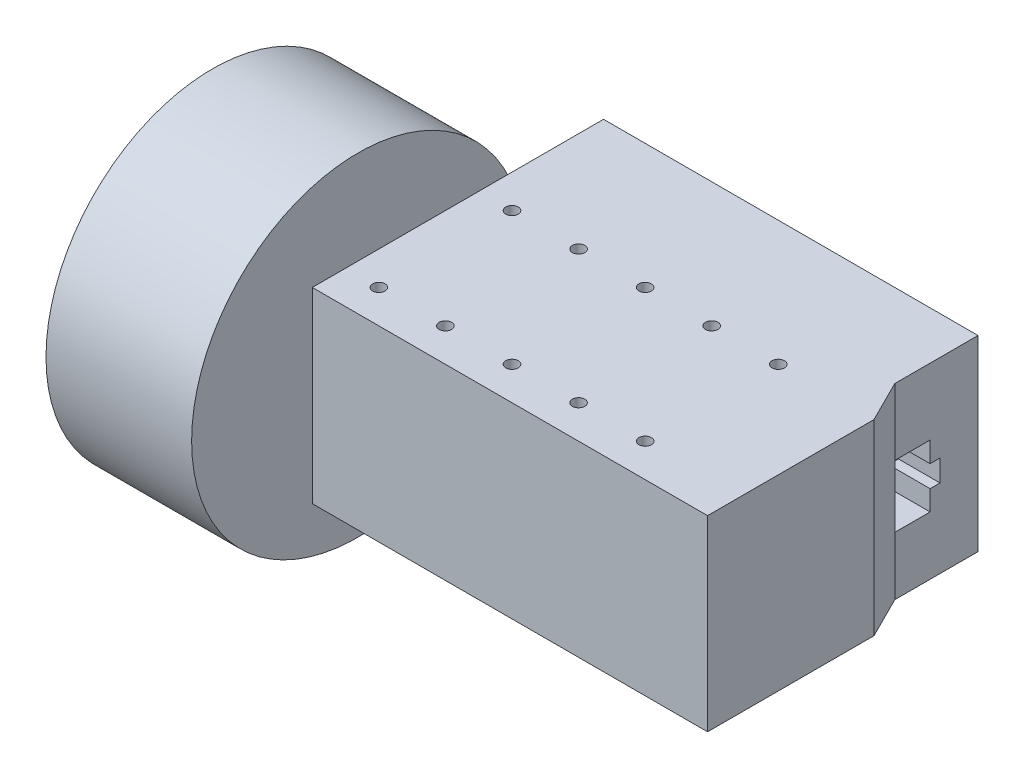
ISO-10303-21;
HEADER;
FILE_DESCRIPTION(('STEP AP214'),'2;1');
FILE_NAME('part.step','',(''),(''),'','','');
FILE_SCHEMA(('AUTOMOTIVE_DESIGN { 1 0 10303 214 1 1 1 1 }'));
ENDSEC;
DATA;
#1=APPLICATION_CONTEXT('core data for automotive mechanical design processes');
#2=APPLICATION_PROTOCOL_DEFINITION('international standard','automotive_design',2000,#1);
#3=PRODUCT_CONTEXT('',#1,'mechanical');
#4=PRODUCT('Part','Part','',(#3));
#5=PRODUCT_RELATED_PRODUCT_CATEGORY('part','',(#4));
#6=PRODUCT_DEFINITION_FORMATION('','',#4);
#7=PRODUCT_DEFINITION_CONTEXT('part definition',#1,'design');
#8=PRODUCT_DEFINITION('design','',#6,#7);
#9=PRODUCT_DEFINITION_SHAPE('','',#8);
#10=(LENGTH_UNIT() NAMED_UNIT(*) SI_UNIT(.MILLI.,.METRE.));
#11=(NAMED_UNIT(*) PLANE_ANGLE_UNIT() SI_UNIT($,.RADIAN.));
#12=(NAMED_UNIT(*) SI_UNIT($,.STERADIAN.) SOLID_ANGLE_UNIT());
#13=UNCERTAINTY_MEASURE_WITH_UNIT(LENGTH_MEASURE(1.E-05),#10,'distance_accuracy_value','');
#14=(GEOMETRIC_REPRESENTATION_CONTEXT(3) GLOBAL_UNCERTAINTY_ASSIGNED_CONTEXT((#13)) GLOBAL_UNIT_ASSIGNED_CONTEXT((#10,
#11,#12)) REPRESENTATION_CONTEXT('',''));
#15=CARTESIAN_POINT('',(0.,0.,0.));
#16=DIRECTION('',(0.,0.,1.));
#17=DIRECTION('',(1.,0.,0.));
#18=AXIS2_PLACEMENT_3D('',#15,#16,#17);
#19=CARTESIAN_POINT('',(0.,45.,0.));
#20=DIRECTION('',(0.,1.,0.));
#21=DIRECTION('',(0.,0.,1.));
#22=AXIS2_PLACEMENT_3D('',#19,#20,#21);
#23=PLANE('',#22);
#24=CARTESIAN_POINT('',(24.4999999999999,45.,-5.));
#25=DIRECTION('',(0.,1.,0.));
#26=DIRECTION('',(0.,0.,1.));
#27=AXIS2_PLACEMENT_3D('',#24,#25,#26);
#28=CIRCLE('',#27,1.5);
#29=CARTESIAN_POINT('',(24.4999999999999,45.,-3.49999999999999));
#30=VERTEX_POINT('',#29);
#31=EDGE_CURVE('E227',#30,#30,#28,.T.);
#32=ORIENTED_EDGE('',*,*,#31,.F.);
#33=EDGE_LOOP('',(#32));
#34=FACE_BOUND('',#33,.T.);
#35=CARTESIAN_POINT('',(-7.50000000000012,45.,-5.));
#36=DIRECTION('',(0.,1.,0.));
#37=DIRECTION('',(0.,0.,1.));
#38=AXIS2_PLACEMENT_3D('',#35,#36,#37);
#39=CIRCLE('',#38,1.5);
#40=CARTESIAN_POINT('',(-7.50000000000012,45.,-3.49999999999999));
#41=VERTEX_POINT('',#40);
#42=EDGE_CURVE('E215',#41,#41,#39,.T.);
#43=ORIENTED_EDGE('',*,*,#42,.F.);
#44=EDGE_LOOP('',(#43));
#45=FACE_BOUND('',#44,.T.);
#46=CARTESIAN_POINT('',(24.5,45.,27.));
#47=DIRECTION('',(0.,1.,0.));
#48=DIRECTION('',(0.,0.,1.));
#49=AXIS2_PLACEMENT_3D('',#46,#47,#48);
#50=CIRCLE('',#49,1.5);
#51=CARTESIAN_POINT('',(24.5,45.,28.5));
#52=VERTEX_POINT('',#51);
#53=EDGE_CURVE('E203',#52,#52,#50,.T.);
#54=ORIENTED_EDGE('',*,*,#53,.F.);
#55=EDGE_LOOP('',(#54));
#56=FACE_BOUND('',#55,.T.);
#57=CARTESIAN_POINT('',(-7.50000000000001,45.,27.));
#58=DIRECTION('',(0.,1.,0.));
#59=DIRECTION('',(0.,0.,1.));
#60=AXIS2_PLACEMENT_3D('',#57,#58,#59);
#61=CIRCLE('',#60,1.5);
#62=CARTESIAN_POINT('',(-7.50000000000001,45.,28.5));
#63=VERTEX_POINT('',#62);
#64=EDGE_CURVE('E191',#63,#63,#61,.T.);
#65=ORIENTED_EDGE('',*,*,#64,.F.);
#66=EDGE_LOOP('',(#65));
#67=FACE_BOUND('',#66,.T.);
#68=CARTESIAN_POINT('',(-39.5,45.,27.));
#69=DIRECTION('',(0.,1.,0.));
#70=DIRECTION('',(0.,0.,1.));
#71=AXIS2_PLACEMENT_3D('',#68,#69,#70);
#72=CIRCLE('',#71,1.5);
#73=CARTESIAN_POINT('',(-39.5,45.,28.5));
#74=VERTEX_POINT('',#73);
#75=EDGE_CURVE('E139',#74,#74,#72,.T.);
#76=ORIENTED_EDGE('',*,*,#75,.F.);
#77=EDGE_LOOP('',(#76));
#78=FACE_BOUND('',#77,.T.);
#79=DIRECTION('',(0.,0.,-1.));
#80=VECTOR('',#79,1.);
#81=CARTESIAN_POINT('',(47.5,45.,-5.));
#82=LINE('',#81,#80);
#83=CARTESIAN_POINT('',(47.5,45.,35.));
#84=VERTEX_POINT('',#83);
#85=CARTESIAN_POINT('',(47.5,45.,-5.));
#86=VERTEX_POINT('',#85);
#87=EDGE_CURVE('E148',#84,#86,#82,.T.);
#88=ORIENTED_EDGE('',*,*,#87,.T.);
#89=DIRECTION('',(-0.44721359549996,0.,-0.894427190999915));
#90=VECTOR('',#89,1.);
#91=CARTESIAN_POINT('',(42.5,45.,-15.));
#92=LINE('',#91,#90);
#93=CARTESIAN_POINT('',(42.5,45.,-15.));
#94=VERTEX_POINT('',#93);
#95=EDGE_CURVE('E97',#86,#94,#92,.T.);
#96=ORIENTED_EDGE('',*,*,#95,.T.);
#97=DIRECTION('',(0.,0.,-1.));
#98=VECTOR('',#97,1.);
#99=CARTESIAN_POINT('',(42.5,45.,-35.));
#100=LINE('',#99,#98);
#101=CARTESIAN_POINT('',(42.5,45.,-35.));
#102=VERTEX_POINT('',#101);
#103=EDGE_CURVE('E114',#94,#102,#100,.T.);
#104=ORIENTED_EDGE('',*,*,#103,.T.);
#105=DIRECTION('',(-1.,0.,0.));
#106=VECTOR('',#105,1.);
#107=CARTESIAN_POINT('',(-47.5,45.,-35.));
#108=LINE('',#107,#106);
#109=CARTESIAN_POINT('',(-47.5,45.,-35.));
#110=VERTEX_POINT('',#109);
#111=EDGE_CURVE('E107',#102,#110,#108,.T.);
#112=ORIENTED_EDGE('',*,*,#111,.T.);
#113=DIRECTION('',(0.,0.,1.));
#114=VECTOR('',#113,1.);
#115=CARTESIAN_POINT('',(-47.5,45.,-35.));
#116=LINE('',#115,#114);
#117=CARTESIAN_POINT('',(-47.5,45.,35.));
#118=VERTEX_POINT('',#117);
#119=EDGE_CURVE('E111',#110,#118,#116,.T.);
#120=ORIENTED_EDGE('',*,*,#119,.T.);
#121=DIRECTION('',(1.,0.,0.));
#122=VECTOR('',#121,1.);
#123=CARTESIAN_POINT('',(-47.5,45.,35.));
#124=LINE('',#123,#122);
#125=EDGE_CURVE('E61',#118,#84,#124,.T.);
#126=ORIENTED_EDGE('',*,*,#125,.T.);
#127=EDGE_LOOP('',(#88,#96,#104,#112,#120,#126));
#128=FACE_BOUND('',#127,.T.);
#129=CARTESIAN_POINT('',(-23.5,45.,27.));
#130=DIRECTION('',(0.,1.,0.));
#131=DIRECTION('',(0.,0.,1.));
#132=AXIS2_PLACEMENT_3D('',#129,#130,#131);
#133=CIRCLE('',#132,1.5);
#134=CARTESIAN_POINT('',(-23.5,45.,28.5));
#135=VERTEX_POINT('',#134);
#136=EDGE_CURVE('E185',#135,#135,#133,.T.);
#137=ORIENTED_EDGE('',*,*,#136,.F.);
#138=EDGE_LOOP('',(#137));
#139=FACE_BOUND('',#138,.T.);
#140=CARTESIAN_POINT('',(8.49999999999999,45.,27.));
#141=DIRECTION('',(0.,1.,0.));
#142=DIRECTION('',(0.,0.,1.));
#143=AXIS2_PLACEMENT_3D('',#140,#141,#142);
#144=CIRCLE('',#143,1.5);
#145=CARTESIAN_POINT('',(8.49999999999999,45.,28.5));
#146=VERTEX_POINT('',#145);
#147=EDGE_CURVE('E197',#146,#146,#144,.T.);
#148=ORIENTED_EDGE('',*,*,#147,.F.);
#149=EDGE_LOOP('',(#148));
#150=FACE_BOUND('',#149,.T.);
#151=CARTESIAN_POINT('',(-23.5000000000001,45.,-5.));
#152=DIRECTION('',(0.,1.,0.));
#153=DIRECTION('',(0.,0.,1.));
#154=AXIS2_PLACEMENT_3D('',#151,#152,#153);
#155=CIRCLE('',#154,1.5);
#156=CARTESIAN_POINT('',(-23.5000000000001,45.,-3.49999999999999));
#157=VERTEX_POINT('',#156);
#158=EDGE_CURVE('E209',#157,#157,#155,.T.);
#159=ORIENTED_EDGE('',*,*,#158,.F.);
#160=EDGE_LOOP('',(#159));
#161=FACE_BOUND('',#160,.T.);
#162=CARTESIAN_POINT('',(8.49999999999988,45.,-5.));
#163=DIRECTION('',(0.,1.,0.));
#164=DIRECTION('',(0.,0.,1.));
#165=AXIS2_PLACEMENT_3D('',#162,#163,#164);
#166=CIRCLE('',#165,1.5);
#167=CARTESIAN_POINT('',(8.49999999999988,45.,-3.49999999999999));
#168=VERTEX_POINT('',#167);
#169=EDGE_CURVE('E221',#168,#168,#166,.T.);
#170=ORIENTED_EDGE('',*,*,#169,.F.);
#171=EDGE_LOOP('',(#170));
#172=FACE_BOUND('',#171,.T.);
#173=CARTESIAN_POINT('',(-39.5000000000001,45.,-5.));
#174=DIRECTION('',(0.,1.,0.));
#175=DIRECTION('',(0.,0.,1.));
#176=AXIS2_PLACEMENT_3D('',#173,#174,#175);
#177=CIRCLE('',#176,1.5);
#178=CARTESIAN_POINT('',(-39.5000000000001,45.,-3.49999999999999));
#179=VERTEX_POINT('',#178);
#180=EDGE_CURVE('E233',#179,#179,#177,.T.);
#181=ORIENTED_EDGE('',*,*,#180,.F.);
#182=EDGE_LOOP('',(#181));
#183=FACE_BOUND('',#182,.T.);
#184=ADVANCED_FACE('F37',(#34,#45,#56,#67,#78,#128,#139,#150,#161,#172,#183),#23,.T.);
#185=CARTESIAN_POINT('',(0.,0.,0.));
#186=DIRECTION('',(0.,1.,0.));
#187=DIRECTION('',(0.,0.,1.));
#188=AXIS2_PLACEMENT_3D('',#185,#186,#187);
#189=PLANE('',#188);
#190=DIRECTION('',(0.,0.,-1.));
#191=VECTOR('',#190,1.);
#192=CARTESIAN_POINT('',(47.5,0.,-5.));
#193=LINE('',#192,#191);
#194=CARTESIAN_POINT('',(47.5,0.,35.));
#195=VERTEX_POINT('',#194);
#196=CARTESIAN_POINT('',(47.5,0.,-5.));
#197=VERTEX_POINT('',#196);
#198=EDGE_CURVE('E135',#195,#197,#193,.T.);
#199=ORIENTED_EDGE('',*,*,#198,.F.);
#200=DIRECTION('',(1.,0.,0.));
#201=VECTOR('',#200,1.);
#202=CARTESIAN_POINT('',(-47.5,0.,35.));
#203=LINE('',#202,#201);
#204=CARTESIAN_POINT('',(-47.5,0.,35.));
#205=VERTEX_POINT('',#204);
#206=EDGE_CURVE('E88',#205,#195,#203,.T.);
#207=ORIENTED_EDGE('',*,*,#206,.F.);
#208=DIRECTION('',(0.,0.,1.));
#209=VECTOR('',#208,1.);
#210=CARTESIAN_POINT('',(-47.5,0.,-35.));
#211=LINE('',#210,#209);
#212=CARTESIAN_POINT('',(-47.5,0.,-35.));
#213=VERTEX_POINT('',#212);
#214=EDGE_CURVE('E145',#213,#205,#211,.T.);
#215=ORIENTED_EDGE('',*,*,#214,.F.);
#216=DIRECTION('',(-1.,0.,0.));
#217=VECTOR('',#216,1.);
#218=CARTESIAN_POINT('',(-47.5,0.,-35.));
#219=LINE('',#218,#217);
#220=CARTESIAN_POINT('',(42.5,0.,-35.));
#221=VERTEX_POINT('',#220);
#222=EDGE_CURVE('E123',#221,#213,#219,.T.);
#223=ORIENTED_EDGE('',*,*,#222,.F.);
#224=DIRECTION('',(0.,0.,-1.));
#225=VECTOR('',#224,1.);
#226=CARTESIAN_POINT('',(42.5,0.,-35.));
#227=LINE('',#226,#225);
#228=CARTESIAN_POINT('',(42.5,0.,-15.));
#229=VERTEX_POINT('',#228);
#230=EDGE_CURVE('E142',#229,#221,#227,.T.);
#231=ORIENTED_EDGE('',*,*,#230,.F.);
#232=DIRECTION('',(-0.44721359549996,0.,-0.894427190999915));
#233=VECTOR('',#232,1.);
#234=CARTESIAN_POINT('',(42.5,0.,-15.));
#235=LINE('',#234,#233);
#236=EDGE_CURVE('E138',#197,#229,#235,.T.);
#237=ORIENTED_EDGE('',*,*,#236,.F.);
#238=EDGE_LOOP('',(#199,#207,#215,#223,#231,#237));
#239=FACE_BOUND('',#238,.T.);
#240=CARTESIAN_POINT('',(-39.5,0.,27.));
#241=DIRECTION('',(0.,1.,0.));
#242=DIRECTION('',(0.,0.,1.));
#243=AXIS2_PLACEMENT_3D('',#240,#241,#242);
#244=CIRCLE('',#243,1.5);
#245=CARTESIAN_POINT('',(-39.5,0.,28.5));
#246=VERTEX_POINT('',#245);
#247=EDGE_CURVE('E182',#246,#246,#244,.T.);
#248=ORIENTED_EDGE('',*,*,#247,.T.);
#249=EDGE_LOOP('',(#248));
#250=FACE_BOUND('',#249,.T.);
#251=CARTESIAN_POINT('',(-23.5,0.,27.));
#252=DIRECTION('',(0.,1.,0.));
#253=DIRECTION('',(0.,0.,1.));
#254=AXIS2_PLACEMENT_3D('',#251,#252,#253);
#255=CIRCLE('',#254,1.5);
#256=CARTESIAN_POINT('',(-23.5,0.,28.5));
#257=VERTEX_POINT('',#256);
#258=EDGE_CURVE('E188',#257,#257,#255,.T.);
#259=ORIENTED_EDGE('',*,*,#258,.T.);
#260=EDGE_LOOP('',(#259));
#261=FACE_BOUND('',#260,.T.);
#262=CARTESIAN_POINT('',(-7.50000000000001,0.,27.));
#263=DIRECTION('',(0.,1.,0.));
#264=DIRECTION('',(0.,0.,1.));
#265=AXIS2_PLACEMENT_3D('',#262,#263,#264);
#266=CIRCLE('',#265,1.5);
#267=CARTESIAN_POINT('',(-7.50000000000001,0.,28.5));
#268=VERTEX_POINT('',#267);
#269=EDGE_CURVE('E194',#268,#268,#266,.T.);
#270=ORIENTED_EDGE('',*,*,#269,.T.);
#271=EDGE_LOOP('',(#270));
#272=FACE_BOUND('',#271,.T.);
#273=CARTESIAN_POINT('',(8.49999999999999,0.,27.));
#274=DIRECTION('',(0.,1.,0.));
#275=DIRECTION('',(0.,0.,1.));
#276=AXIS2_PLACEMENT_3D('',#273,#274,#275);
#277=CIRCLE('',#276,1.5);
#278=CARTESIAN_POINT('',(8.49999999999999,0.,28.5));
#279=VERTEX_POINT('',#278);
#280=EDGE_CURVE('E200',#279,#279,#277,.T.);
#281=ORIENTED_EDGE('',*,*,#280,.T.);
#282=EDGE_LOOP('',(#281));
#283=FACE_BOUND('',#282,.T.);
#284=CARTESIAN_POINT('',(24.5,0.,27.));
#285=DIRECTION('',(0.,1.,0.));
#286=DIRECTION('',(0.,0.,1.));
#287=AXIS2_PLACEMENT_3D('',#284,#285,#286);
#288=CIRCLE('',#287,1.5);
#289=CARTESIAN_POINT('',(24.5,0.,28.5));
#290=VERTEX_POINT('',#289);
#291=EDGE_CURVE('E206',#290,#290,#288,.T.);
#292=ORIENTED_EDGE('',*,*,#291,.T.);
#293=EDGE_LOOP('',(#292));
#294=FACE_BOUND('',#293,.T.);
#295=CARTESIAN_POINT('',(-23.5000000000001,0.,-5.));
#296=DIRECTION('',(0.,1.,0.));
#297=DIRECTION('',(0.,0.,1.));
#298=AXIS2_PLACEMENT_3D('',#295,#296,#297);
#299=CIRCLE('',#298,1.5);
#300=CARTESIAN_POINT('',(-23.5000000000001,0.,-3.49999999999999));
#301=VERTEX_POINT('',#300);
#302=EDGE_CURVE('E212',#301,#301,#299,.T.);
#303=ORIENTED_EDGE('',*,*,#302,.T.);
#304=EDGE_LOOP('',(#303));
#305=FACE_BOUND('',#304,.T.);
#306=CARTESIAN_POINT('',(-7.50000000000012,0.,-5.));
#307=DIRECTION('',(0.,1.,0.));
#308=DIRECTION('',(0.,0.,1.));
#309=AXIS2_PLACEMENT_3D('',#306,#307,#308);
#310=CIRCLE('',#309,1.5);
#311=CARTESIAN_POINT('',(-7.50000000000012,0.,-3.49999999999999));
#312=VERTEX_POINT('',#311);
#313=EDGE_CURVE('E218',#312,#312,#310,.T.);
#314=ORIENTED_EDGE('',*,*,#313,.T.);
#315=EDGE_LOOP('',(#314));
#316=FACE_BOUND('',#315,.T.);
#317=CARTESIAN_POINT('',(8.49999999999988,0.,-5.));
#318=DIRECTION('',(0.,1.,0.));
#319=DIRECTION('',(0.,0.,1.));
#320=AXIS2_PLACEMENT_3D('',#317,#318,#319);
#321=CIRCLE('',#320,1.5);
#322=CARTESIAN_POINT('',(8.49999999999988,0.,-3.49999999999999));
#323=VERTEX_POINT('',#322);
#324=EDGE_CURVE('E224',#323,#323,#321,.T.);
#325=ORIENTED_EDGE('',*,*,#324,.T.);
#326=EDGE_LOOP('',(#325));
#327=FACE_BOUND('',#326,.T.);
#328=CARTESIAN_POINT('',(24.4999999999999,0.,-5.));
#329=DIRECTION('',(0.,1.,0.));
#330=DIRECTION('',(0.,0.,1.));
#331=AXIS2_PLACEMENT_3D('',#328,#329,#330);
#332=CIRCLE('',#331,1.5);
#333=CARTESIAN_POINT('',(24.4999999999999,0.,-3.49999999999999));
#334=VERTEX_POINT('',#333);
#335=EDGE_CURVE('E230',#334,#334,#332,.T.);
#336=ORIENTED_EDGE('',*,*,#335,.T.);
#337=EDGE_LOOP('',(#336));
#338=FACE_BOUND('',#337,.T.);
#339=CARTESIAN_POINT('',(-39.5000000000001,0.,-5.));
#340=DIRECTION('',(0.,1.,0.));
#341=DIRECTION('',(0.,0.,1.));
#342=AXIS2_PLACEMENT_3D('',#339,#340,#341);
#343=CIRCLE('',#342,1.5);
#344=CARTESIAN_POINT('',(-39.5000000000001,0.,-3.49999999999999));
#345=VERTEX_POINT('',#344);
#346=EDGE_CURVE('E236',#345,#345,#343,.T.);
#347=ORIENTED_EDGE('',*,*,#346,.T.);
#348=EDGE_LOOP('',(#347));
#349=FACE_BOUND('',#348,.T.);
#350=ADVANCED_FACE('F163',(#239,#250,#261,#272,#283,#294,#305,#316,#327,#338,#349),#189,.F.);
#351=CARTESIAN_POINT('',(47.5,45.,-5.));
#352=DIRECTION('',(-1.,0.,0.));
#353=DIRECTION('',(0.,0.,1.));
#354=AXIS2_PLACEMENT_3D('',#351,#352,#353);
#355=PLANE('',#354);
#356=ORIENTED_EDGE('',*,*,#198,.T.);
#357=DIRECTION('',(0.,-1.,0.));
#358=VECTOR('',#357,1.);
#359=CARTESIAN_POINT('',(47.5,45.,-5.));
#360=LINE('',#359,#358);
#361=EDGE_CURVE('E45',#86,#197,#360,.T.);
#362=ORIENTED_EDGE('',*,*,#361,.F.);
#363=ORIENTED_EDGE('',*,*,#87,.F.);
#364=DIRECTION('',(0.,-1.,0.));
#365=VECTOR('',#364,1.);
#366=CARTESIAN_POINT('',(47.5,45.,35.));
#367=LINE('',#366,#365);
#368=EDGE_CURVE('E131',#84,#195,#367,.T.);
#369=ORIENTED_EDGE('',*,*,#368,.T.);
#370=EDGE_LOOP('',(#356,#362,#363,#369));
#371=FACE_BOUND('',#370,.T.);
#372=ADVANCED_FACE('F39',(#371),#355,.F.);
#373=CARTESIAN_POINT('',(42.5,45.,-15.));
#374=DIRECTION('',(-0.894427190999915,0.,0.44721359549996));
#375=DIRECTION('',(0.44721359549996,0.,0.894427190999915));
#376=AXIS2_PLACEMENT_3D('',#373,#374,#375);
#377=PLANE('',#376);
#378=ORIENTED_EDGE('',*,*,#236,.T.);
#379=DIRECTION('',(0.,-1.,0.));
#380=VECTOR('',#379,1.);
#381=CARTESIAN_POINT('',(42.5,45.,-15.));
#382=LINE('',#381,#380);
#383=CARTESIAN_POINT('',(42.5,14.0286618360256,-15.));
#384=VERTEX_POINT('',#383);
#385=EDGE_CURVE('E152',#384,#229,#382,.T.);
#386=ORIENTED_EDGE('',*,*,#385,.F.);
#387=DIRECTION('',(0.,-1.,0.));
#388=VECTOR('',#387,1.);
#389=CARTESIAN_POINT('',(42.5,29.0012866665222,-15.));
#390=LINE('',#389,#388);
#391=CARTESIAN_POINT('',(42.5,29.0012866665222,-15.));
#392=VERTEX_POINT('',#391);
#393=EDGE_CURVE('E52',#392,#384,#390,.T.);
#394=ORIENTED_EDGE('',*,*,#393,.F.);
#395=EDGE_CURVE('E153',#94,#392,#382,.T.);
#396=ORIENTED_EDGE('',*,*,#395,.F.);
#397=ORIENTED_EDGE('',*,*,#95,.F.);
#398=ORIENTED_EDGE('',*,*,#361,.T.);
#399=EDGE_LOOP('',(#378,#386,#394,#396,#397,#398));
#400=FACE_BOUND('',#399,.T.);
#401=ADVANCED_FACE('F156',(#400),#377,.F.);
#402=CARTESIAN_POINT('',(42.5,45.,-35.));
#403=DIRECTION('',(-1.,0.,0.));
#404=DIRECTION('',(0.,0.,1.));
#405=AXIS2_PLACEMENT_3D('',#402,#403,#404);
#406=PLANE('',#405);
#407=ORIENTED_EDGE('',*,*,#395,.T.);
#408=DIRECTION('',(0.,0.,1.));
#409=VECTOR('',#408,1.);
#410=CARTESIAN_POINT('',(42.5,29.0012866665222,-15.));
#411=LINE('',#410,#409);
#412=CARTESIAN_POINT('',(42.5,29.0012866665222,-23.4887163929281));
#413=VERTEX_POINT('',#412);
#414=EDGE_CURVE('E178',#413,#392,#411,.T.);
#415=ORIENTED_EDGE('',*,*,#414,.F.);
#416=DIRECTION('',(0.,1.,0.));
#417=VECTOR('',#416,1.);
#418=CARTESIAN_POINT('',(42.5,29.0012866665222,-23.4887163929281));
#419=LINE('',#418,#417);
#420=CARTESIAN_POINT('',(42.5,24.0691278988292,-23.4887163929281));
#421=VERTEX_POINT('',#420);
#422=EDGE_CURVE('E266',#421,#413,#419,.T.);
#423=ORIENTED_EDGE('',*,*,#422,.F.);
#424=DIRECTION('',(0.,0.,1.));
#425=VECTOR('',#424,1.);
#426=CARTESIAN_POINT('',(42.5,24.0691278988292,-25.8667215130658));
#427=LINE('',#426,#425);
#428=CARTESIAN_POINT('',(42.5,24.0691278988292,-25.8667215130658));
#429=VERTEX_POINT('',#428);
#430=EDGE_CURVE('E269',#429,#421,#427,.T.);
#431=ORIENTED_EDGE('',*,*,#430,.F.);
#432=DIRECTION('',(0.,1.,0.));
#433=VECTOR('',#432,1.);
#434=CARTESIAN_POINT('',(42.5,24.0691278988292,-25.8667215130658));
#435=LINE('',#434,#433);
#436=CARTESIAN_POINT('',(42.5,18.8727463400098,-25.8667215130658));
#437=VERTEX_POINT('',#436);
#438=EDGE_CURVE('E272',#437,#429,#435,.T.);
#439=ORIENTED_EDGE('',*,*,#438,.F.);
#440=DIRECTION('',(0.,0.,-1.));
#441=VECTOR('',#440,1.);
#442=CARTESIAN_POINT('',(42.5,18.8727463400098,-25.8667215130658));
#443=LINE('',#442,#441);
#444=CARTESIAN_POINT('',(42.5,18.8727463400098,-23.4887163929281));
#445=VERTEX_POINT('',#444);
#446=EDGE_CURVE('E275',#445,#437,#443,.T.);
#447=ORIENTED_EDGE('',*,*,#446,.F.);
#448=DIRECTION('',(0.,1.,0.));
#449=VECTOR('',#448,1.);
#450=CARTESIAN_POINT('',(42.5,14.0286618360256,-23.4887163929281));
#451=LINE('',#450,#449);
#452=CARTESIAN_POINT('',(42.5,14.0286618360256,-23.4887163929281));
#453=VERTEX_POINT('',#452);
#454=EDGE_CURVE('E278',#453,#445,#451,.T.);
#455=ORIENTED_EDGE('',*,*,#454,.F.);
#456=DIRECTION('',(0.,0.,-1.));
#457=VECTOR('',#456,1.);
#458=CARTESIAN_POINT('',(42.5,14.0286618360256,-15.));
#459=LINE('',#458,#457);
#460=EDGE_CURVE('E170',#384,#453,#459,.T.);
#461=ORIENTED_EDGE('',*,*,#460,.F.);
#462=ORIENTED_EDGE('',*,*,#385,.T.);
#463=ORIENTED_EDGE('',*,*,#230,.T.);
#464=DIRECTION('',(0.,-1.,0.));
#465=VECTOR('',#464,1.);
#466=CARTESIAN_POINT('',(42.5,45.,-35.));
#467=LINE('',#466,#465);
#468=EDGE_CURVE('E126',#102,#221,#467,.T.);
#469=ORIENTED_EDGE('',*,*,#468,.F.);
#470=ORIENTED_EDGE('',*,*,#103,.F.);
#471=EDGE_LOOP('',(#407,#415,#423,#431,#439,#447,#455,#461,#462,#463,#469,#470));
#472=FACE_BOUND('',#471,.T.);
#473=ADVANCED_FACE('F166',(#472),#406,.F.);
#474=CARTESIAN_POINT('',(-47.5,45.,-35.));
#475=DIRECTION('',(0.,0.,1.));
#476=DIRECTION('',(1.,0.,0.));
#477=AXIS2_PLACEMENT_3D('',#474,#475,#476);
#478=PLANE('',#477);
#479=ORIENTED_EDGE('',*,*,#222,.T.);
#480=DIRECTION('',(0.,-1.,0.));
#481=VECTOR('',#480,1.);
#482=CARTESIAN_POINT('',(-47.5,45.,-35.));
#483=LINE('',#482,#481);
#484=EDGE_CURVE('E120',#110,#213,#483,.T.);
#485=ORIENTED_EDGE('',*,*,#484,.F.);
#486=ORIENTED_EDGE('',*,*,#111,.F.);
#487=ORIENTED_EDGE('',*,*,#468,.T.);
#488=EDGE_LOOP('',(#479,#485,#486,#487));
#489=FACE_BOUND('',#488,.T.);
#490=ADVANCED_FACE('F121',(#489),#478,.F.);
#491=CARTESIAN_POINT('',(-47.5,45.,-35.));
#492=DIRECTION('',(1.,0.,0.));
#493=DIRECTION('',(0.,0.,-1.));
#494=AXIS2_PLACEMENT_3D('',#491,#492,#493);
#495=PLANE('',#494);
#496=CARTESIAN_POINT('',(-47.5,22.5,19.));
#497=DIRECTION('',(1.,0.,0.));
#498=DIRECTION('',(0.,0.,-1.));
#499=AXIS2_PLACEMENT_3D('',#496,#497,#498);
#500=CIRCLE('',#499,3.);
#501=CARTESIAN_POINT('',(-47.5,22.5,16.));
#502=VERTEX_POINT('',#501);
#503=EDGE_CURVE('E11',#502,#502,#500,.F.);
#504=ORIENTED_EDGE('',*,*,#503,.F.);
#505=EDGE_LOOP('',(#504));
#506=FACE_BOUND('',#505,.T.);
#507=ORIENTED_EDGE('',*,*,#214,.T.);
#508=DIRECTION('',(0.,-1.,0.));
#509=VECTOR('',#508,1.);
#510=CARTESIAN_POINT('',(-47.5,45.,35.));
#511=LINE('',#510,#509);
#512=EDGE_CURVE('E127',#118,#205,#511,.T.);
#513=ORIENTED_EDGE('',*,*,#512,.F.);
#514=ORIENTED_EDGE('',*,*,#119,.F.);
#515=ORIENTED_EDGE('',*,*,#484,.T.);
#516=EDGE_LOOP('',(#507,#513,#514,#515));
#517=FACE_BOUND('',#516,.T.);
#518=ADVANCED_FACE('F129',(#506,#517),#495,.F.);
#519=CARTESIAN_POINT('',(-47.5,45.,35.));
#520=DIRECTION('',(0.,0.,-1.));
#521=DIRECTION('',(-1.,0.,0.));
#522=AXIS2_PLACEMENT_3D('',#519,#520,#521);
#523=PLANE('',#522);
#524=ORIENTED_EDGE('',*,*,#206,.T.);
#525=ORIENTED_EDGE('',*,*,#368,.F.);
#526=ORIENTED_EDGE('',*,*,#125,.F.);
#527=ORIENTED_EDGE('',*,*,#512,.T.);
#528=EDGE_LOOP('',(#524,#525,#526,#527));
#529=FACE_BOUND('',#528,.T.);
#530=ADVANCED_FACE('F343',(#529),#523,.F.);
#531=CARTESIAN_POINT('',(-39.5,45.,27.));
#532=DIRECTION('',(0.,-1.,0.));
#533=DIRECTION('',(0.,0.,-1.));
#534=AXIS2_PLACEMENT_3D('',#531,#532,#533);
#535=CYLINDRICAL_SURFACE('',#534,1.5);
#536=ORIENTED_EDGE('',*,*,#75,.T.);
#537=EDGE_LOOP('',(#536));
#538=FACE_BOUND('',#537,.T.);
#539=ORIENTED_EDGE('',*,*,#247,.F.);
#540=EDGE_LOOP('',(#539));
#541=FACE_BOUND('',#540,.T.);
#542=ADVANCED_FACE('F340',(#538,#541),#535,.F.);
#543=CARTESIAN_POINT('',(-23.5,45.,27.));
#544=DIRECTION('',(0.,-1.,0.));
#545=DIRECTION('',(0.,0.,-1.));
#546=AXIS2_PLACEMENT_3D('',#543,#544,#545);
#547=CYLINDRICAL_SURFACE('',#546,1.5);
#548=ORIENTED_EDGE('',*,*,#136,.T.);
#549=EDGE_LOOP('',(#548));
#550=FACE_BOUND('',#549,.T.);
#551=ORIENTED_EDGE('',*,*,#258,.F.);
#552=EDGE_LOOP('',(#551));
#553=FACE_BOUND('',#552,.T.);
#554=ADVANCED_FACE('F406',(#550,#553),#547,.F.);
#555=CARTESIAN_POINT('',(-7.50000000000001,45.,27.));
#556=DIRECTION('',(0.,-1.,0.));
#557=DIRECTION('',(0.,0.,-1.));
#558=AXIS2_PLACEMENT_3D('',#555,#556,#557);
#559=CYLINDRICAL_SURFACE('',#558,1.5);
#560=ORIENTED_EDGE('',*,*,#64,.T.);
#561=EDGE_LOOP('',(#560));
#562=FACE_BOUND('',#561,.T.);
#563=ORIENTED_EDGE('',*,*,#269,.F.);
#564=EDGE_LOOP('',(#563));
#565=FACE_BOUND('',#564,.T.);
#566=ADVANCED_FACE('F414',(#562,#565),#559,.F.);
#567=CARTESIAN_POINT('',(8.49999999999999,45.,27.));
#568=DIRECTION('',(0.,-1.,0.));
#569=DIRECTION('',(0.,0.,-1.));
#570=AXIS2_PLACEMENT_3D('',#567,#568,#569);
#571=CYLINDRICAL_SURFACE('',#570,1.5);
#572=ORIENTED_EDGE('',*,*,#147,.T.);
#573=EDGE_LOOP('',(#572));
#574=FACE_BOUND('',#573,.T.);
#575=ORIENTED_EDGE('',*,*,#280,.F.);
#576=EDGE_LOOP('',(#575));
#577=FACE_BOUND('',#576,.T.);
#578=ADVANCED_FACE('F422',(#574,#577),#571,.F.);
#579=CARTESIAN_POINT('',(24.5,45.,27.));
#580=DIRECTION('',(0.,-1.,0.));
#581=DIRECTION('',(0.,0.,-1.));
#582=AXIS2_PLACEMENT_3D('',#579,#580,#581);
#583=CYLINDRICAL_SURFACE('',#582,1.5);
#584=ORIENTED_EDGE('',*,*,#53,.T.);
#585=EDGE_LOOP('',(#584));
#586=FACE_BOUND('',#585,.T.);
#587=ORIENTED_EDGE('',*,*,#291,.F.);
#588=EDGE_LOOP('',(#587));
#589=FACE_BOUND('',#588,.T.);
#590=ADVANCED_FACE('F431',(#586,#589),#583,.F.);
#591=CARTESIAN_POINT('',(-23.5000000000001,45.,-5.));
#592=DIRECTION('',(0.,-1.,0.));
#593=DIRECTION('',(0.,0.,-1.));
#594=AXIS2_PLACEMENT_3D('',#591,#592,#593);
#595=CYLINDRICAL_SURFACE('',#594,1.5);
#596=ORIENTED_EDGE('',*,*,#158,.T.);
#597=EDGE_LOOP('',(#596));
#598=FACE_BOUND('',#597,.T.);
#599=ORIENTED_EDGE('',*,*,#302,.F.);
#600=EDGE_LOOP('',(#599));
#601=FACE_BOUND('',#600,.T.);
#602=ADVANCED_FACE('F440',(#598,#601),#595,.F.);
#603=CARTESIAN_POINT('',(-7.50000000000012,45.,-5.));
#604=DIRECTION('',(0.,-1.,0.));
#605=DIRECTION('',(0.,0.,-1.));
#606=AXIS2_PLACEMENT_3D('',#603,#604,#605);
#607=CYLINDRICAL_SURFACE('',#606,1.5);
#608=ORIENTED_EDGE('',*,*,#42,.T.);
#609=EDGE_LOOP('',(#608));
#610=FACE_BOUND('',#609,.T.);
#611=ORIENTED_EDGE('',*,*,#313,.F.);
#612=EDGE_LOOP('',(#611));
#613=FACE_BOUND('',#612,.T.);
#614=ADVANCED_FACE('F449',(#610,#613),#607,.F.);
#615=CARTESIAN_POINT('',(8.49999999999988,45.,-5.));
#616=DIRECTION('',(0.,-1.,0.));
#617=DIRECTION('',(0.,0.,-1.));
#618=AXIS2_PLACEMENT_3D('',#615,#616,#617);
#619=CYLINDRICAL_SURFACE('',#618,1.5);
#620=ORIENTED_EDGE('',*,*,#169,.T.);
#621=EDGE_LOOP('',(#620));
#622=FACE_BOUND('',#621,.T.);
#623=ORIENTED_EDGE('',*,*,#324,.F.);
#624=EDGE_LOOP('',(#623));
#625=FACE_BOUND('',#624,.T.);
#626=ADVANCED_FACE('F458',(#622,#625),#619,.F.);
#627=CARTESIAN_POINT('',(24.4999999999999,45.,-5.));
#628=DIRECTION('',(0.,-1.,0.));
#629=DIRECTION('',(0.,0.,-1.));
#630=AXIS2_PLACEMENT_3D('',#627,#628,#629);
#631=CYLINDRICAL_SURFACE('',#630,1.5);
#632=ORIENTED_EDGE('',*,*,#31,.T.);
#633=EDGE_LOOP('',(#632));
#634=FACE_BOUND('',#633,.T.);
#635=ORIENTED_EDGE('',*,*,#335,.F.);
#636=EDGE_LOOP('',(#635));
#637=FACE_BOUND('',#636,.T.);
#638=ADVANCED_FACE('F467',(#634,#637),#631,.F.);
#639=CARTESIAN_POINT('',(-39.5000000000001,45.,-5.));
#640=DIRECTION('',(0.,-1.,0.));
#641=DIRECTION('',(0.,0.,-1.));
#642=AXIS2_PLACEMENT_3D('',#639,#640,#641);
#643=CYLINDRICAL_SURFACE('',#642,1.5);
#644=ORIENTED_EDGE('',*,*,#180,.T.);
#645=EDGE_LOOP('',(#644));
#646=FACE_BOUND('',#645,.T.);
#647=ORIENTED_EDGE('',*,*,#346,.F.);
#648=EDGE_LOOP('',(#647));
#649=FACE_BOUND('',#648,.T.);
#650=ADVANCED_FACE('F476',(#646,#649),#643,.F.);
#651=CARTESIAN_POINT('',(32.5,29.0012866665222,-15.));
#652=DIRECTION('',(0.,0.,1.));
#653=DIRECTION('',(1.,0.,0.));
#654=AXIS2_PLACEMENT_3D('',#651,#652,#653);
#655=PLANE('',#654);
#656=ORIENTED_EDGE('',*,*,#393,.T.);
#657=DIRECTION('',(1.,0.,0.));
#658=VECTOR('',#657,1.);
#659=CARTESIAN_POINT('',(32.5,14.0286618360256,-15.));
#660=LINE('',#659,#658);
#661=CARTESIAN_POINT('',(32.5,14.0286618360256,-15.));
#662=VERTEX_POINT('',#661);
#663=EDGE_CURVE('E242',#662,#384,#660,.T.);
#664=ORIENTED_EDGE('',*,*,#663,.F.);
#665=DIRECTION('',(0.,-1.,0.));
#666=VECTOR('',#665,1.);
#667=CARTESIAN_POINT('',(32.5,29.0012866665222,-15.));
#668=LINE('',#667,#666);
#669=CARTESIAN_POINT('',(32.5,29.0012866665222,-15.));
#670=VERTEX_POINT('',#669);
#671=EDGE_CURVE('E265',#670,#662,#668,.T.);
#672=ORIENTED_EDGE('',*,*,#671,.F.);
#673=DIRECTION('',(1.,0.,0.));
#674=VECTOR('',#673,1.);
#675=CARTESIAN_POINT('',(32.5,29.0012866665222,-15.));
#676=LINE('',#675,#674);
#677=EDGE_CURVE('E239',#670,#392,#676,.T.);
#678=ORIENTED_EDGE('',*,*,#677,.T.);
#679=EDGE_LOOP('',(#656,#664,#672,#678));
#680=FACE_BOUND('',#679,.T.);
#681=ADVANCED_FACE('F484',(#680),#655,.F.);
#682=CARTESIAN_POINT('',(32.5,29.0012866665222,-15.));
#683=DIRECTION('',(0.,1.,0.));
#684=DIRECTION('',(0.,0.,1.));
#685=AXIS2_PLACEMENT_3D('',#682,#683,#684);
#686=PLANE('',#685);
#687=ORIENTED_EDGE('',*,*,#414,.T.);
#688=ORIENTED_EDGE('',*,*,#677,.F.);
#689=DIRECTION('',(0.,0.,1.));
#690=VECTOR('',#689,1.);
#691=CARTESIAN_POINT('',(32.5,29.0012866665222,-15.));
#692=LINE('',#691,#690);
#693=CARTESIAN_POINT('',(32.5,29.0012866665222,-23.4887163929281));
#694=VERTEX_POINT('',#693);
#695=EDGE_CURVE('E245',#694,#670,#692,.T.);
#696=ORIENTED_EDGE('',*,*,#695,.F.);
#697=DIRECTION('',(1.,0.,0.));
#698=VECTOR('',#697,1.);
#699=CARTESIAN_POINT('',(32.5,29.0012866665222,-23.4887163929281));
#700=LINE('',#699,#698);
#701=EDGE_CURVE('E260',#694,#413,#700,.T.);
#702=ORIENTED_EDGE('',*,*,#701,.T.);
#703=EDGE_LOOP('',(#687,#688,#696,#702));
#704=FACE_BOUND('',#703,.T.);
#705=ADVANCED_FACE('F492',(#704),#686,.F.);
#706=CARTESIAN_POINT('',(32.5,29.0012866665222,-23.4887163929281));
#707=DIRECTION('',(0.,0.,-1.));
#708=DIRECTION('',(-1.,0.,0.));
#709=AXIS2_PLACEMENT_3D('',#706,#707,#708);
#710=PLANE('',#709);
#711=ORIENTED_EDGE('',*,*,#422,.T.);
#712=ORIENTED_EDGE('',*,*,#701,.F.);
#713=DIRECTION('',(0.,1.,0.));
#714=VECTOR('',#713,1.);
#715=CARTESIAN_POINT('',(32.5,29.0012866665222,-23.4887163929281));
#716=LINE('',#715,#714);
#717=CARTESIAN_POINT('',(32.5,24.0691278988292,-23.4887163929281));
#718=VERTEX_POINT('',#717);
#719=EDGE_CURVE('E284',#718,#694,#716,.T.);
#720=ORIENTED_EDGE('',*,*,#719,.F.);
#721=DIRECTION('',(1.,0.,0.));
#722=VECTOR('',#721,1.);
#723=CARTESIAN_POINT('',(32.5,24.0691278988292,-23.4887163929281));
#724=LINE('',#723,#722);
#725=EDGE_CURVE('E257',#718,#421,#724,.T.);
#726=ORIENTED_EDGE('',*,*,#725,.T.);
#727=EDGE_LOOP('',(#711,#712,#720,#726));
#728=FACE_BOUND('',#727,.T.);
#729=ADVANCED_FACE('F500',(#728),#710,.F.);
#730=CARTESIAN_POINT('',(32.5,24.0691278988292,-25.8667215130658));
#731=DIRECTION('',(0.,1.,0.));
#732=DIRECTION('',(0.,0.,1.));
#733=AXIS2_PLACEMENT_3D('',#730,#731,#732);
#734=PLANE('',#733);
#735=ORIENTED_EDGE('',*,*,#430,.T.);
#736=ORIENTED_EDGE('',*,*,#725,.F.);
#737=DIRECTION('',(0.,0.,1.));
#738=VECTOR('',#737,1.);
#739=CARTESIAN_POINT('',(32.5,24.0691278988292,-25.8667215130658));
#740=LINE('',#739,#738);
#741=CARTESIAN_POINT('',(32.5,24.0691278988292,-25.8667215130658));
#742=VERTEX_POINT('',#741);
#743=EDGE_CURVE('E287',#742,#718,#740,.T.);
#744=ORIENTED_EDGE('',*,*,#743,.F.);
#745=DIRECTION('',(1.,0.,0.));
#746=VECTOR('',#745,1.);
#747=CARTESIAN_POINT('',(32.5,24.0691278988292,-25.8667215130658));
#748=LINE('',#747,#746);
#749=EDGE_CURVE('E254',#742,#429,#748,.T.);
#750=ORIENTED_EDGE('',*,*,#749,.T.);
#751=EDGE_LOOP('',(#735,#736,#744,#750));
#752=FACE_BOUND('',#751,.T.);
#753=ADVANCED_FACE('F509',(#752),#734,.F.);
#754=CARTESIAN_POINT('',(32.5,24.0691278988292,-25.8667215130658));
#755=DIRECTION('',(0.,0.,-1.));
#756=DIRECTION('',(-1.,0.,0.));
#757=AXIS2_PLACEMENT_3D('',#754,#755,#756);
#758=PLANE('',#757);
#759=ORIENTED_EDGE('',*,*,#438,.T.);
#760=ORIENTED_EDGE('',*,*,#749,.F.);
#761=DIRECTION('',(0.,1.,0.));
#762=VECTOR('',#761,1.);
#763=CARTESIAN_POINT('',(32.5,24.0691278988292,-25.8667215130658));
#764=LINE('',#763,#762);
#765=CARTESIAN_POINT('',(32.5,18.8727463400098,-25.8667215130658));
#766=VERTEX_POINT('',#765);
#767=EDGE_CURVE('E290',#766,#742,#764,.T.);
#768=ORIENTED_EDGE('',*,*,#767,.F.);
#769=DIRECTION('',(1.,0.,0.));
#770=VECTOR('',#769,1.);
#771=CARTESIAN_POINT('',(32.5,18.8727463400098,-25.8667215130658));
#772=LINE('',#771,#770);
#773=EDGE_CURVE('E251',#766,#437,#772,.T.);
#774=ORIENTED_EDGE('',*,*,#773,.T.);
#775=EDGE_LOOP('',(#759,#760,#768,#774));
#776=FACE_BOUND('',#775,.T.);
#777=ADVANCED_FACE('F518',(#776),#758,.F.);
#778=CARTESIAN_POINT('',(32.5,18.8727463400098,-25.8667215130658));
#779=DIRECTION('',(0.,-1.,0.));
#780=DIRECTION('',(0.,0.,-1.));
#781=AXIS2_PLACEMENT_3D('',#778,#779,#780);
#782=PLANE('',#781);
#783=ORIENTED_EDGE('',*,*,#446,.T.);
#784=ORIENTED_EDGE('',*,*,#773,.F.);
#785=DIRECTION('',(0.,0.,-1.));
#786=VECTOR('',#785,1.);
#787=CARTESIAN_POINT('',(32.5,18.8727463400098,-25.8667215130658));
#788=LINE('',#787,#786);
#789=CARTESIAN_POINT('',(32.5,18.8727463400098,-23.4887163929281));
#790=VERTEX_POINT('',#789);
#791=EDGE_CURVE('E293',#790,#766,#788,.T.);
#792=ORIENTED_EDGE('',*,*,#791,.F.);
#793=DIRECTION('',(1.,0.,0.));
#794=VECTOR('',#793,1.);
#795=CARTESIAN_POINT('',(32.5,18.8727463400098,-23.4887163929281));
#796=LINE('',#795,#794);
#797=EDGE_CURVE('E248',#790,#445,#796,.T.);
#798=ORIENTED_EDGE('',*,*,#797,.T.);
#799=EDGE_LOOP('',(#783,#784,#792,#798));
#800=FACE_BOUND('',#799,.T.);
#801=ADVANCED_FACE('F527',(#800),#782,.F.);
#802=CARTESIAN_POINT('',(32.5,14.0286618360256,-23.4887163929281));
#803=DIRECTION('',(0.,0.,-1.));
#804=DIRECTION('',(-1.,0.,0.));
#805=AXIS2_PLACEMENT_3D('',#802,#803,#804);
#806=PLANE('',#805);
#807=ORIENTED_EDGE('',*,*,#454,.T.);
#808=ORIENTED_EDGE('',*,*,#797,.F.);
#809=DIRECTION('',(0.,1.,0.));
#810=VECTOR('',#809,1.);
#811=CARTESIAN_POINT('',(32.5,14.0286618360256,-23.4887163929281));
#812=LINE('',#811,#810);
#813=CARTESIAN_POINT('',(32.5,14.0286618360256,-23.4887163929281));
#814=VERTEX_POINT('',#813);
#815=EDGE_CURVE('E296',#814,#790,#812,.T.);
#816=ORIENTED_EDGE('',*,*,#815,.F.);
#817=DIRECTION('',(1.,0.,0.));
#818=VECTOR('',#817,1.);
#819=CARTESIAN_POINT('',(32.5,14.0286618360256,-23.4887163929281));
#820=LINE('',#819,#818);
#821=EDGE_CURVE('E244',#814,#453,#820,.T.);
#822=ORIENTED_EDGE('',*,*,#821,.T.);
#823=EDGE_LOOP('',(#807,#808,#816,#822));
#824=FACE_BOUND('',#823,.T.);
#825=ADVANCED_FACE('F536',(#824),#806,.F.);
#826=CARTESIAN_POINT('',(32.5,14.0286618360256,-15.));
#827=DIRECTION('',(0.,-1.,0.));
#828=DIRECTION('',(0.,0.,-1.));
#829=AXIS2_PLACEMENT_3D('',#826,#827,#828);
#830=PLANE('',#829);
#831=ORIENTED_EDGE('',*,*,#460,.T.);
#832=ORIENTED_EDGE('',*,*,#821,.F.);
#833=DIRECTION('',(0.,0.,-1.));
#834=VECTOR('',#833,1.);
#835=CARTESIAN_POINT('',(32.5,14.0286618360256,-15.));
#836=LINE('',#835,#834);
#837=EDGE_CURVE('E299',#662,#814,#836,.T.);
#838=ORIENTED_EDGE('',*,*,#837,.F.);
#839=ORIENTED_EDGE('',*,*,#663,.T.);
#840=EDGE_LOOP('',(#831,#832,#838,#839));
#841=FACE_BOUND('',#840,.T.);
#842=ADVANCED_FACE('F545',(#841),#830,.F.);
#843=CARTESIAN_POINT('',(32.5,0.,0.));
#844=DIRECTION('',(1.,0.,0.));
#845=DIRECTION('',(0.,0.,-1.));
#846=AXIS2_PLACEMENT_3D('',#843,#844,#845);
#847=PLANE('',#846);
#848=ORIENTED_EDGE('',*,*,#671,.T.);
#849=ORIENTED_EDGE('',*,*,#837,.T.);
#850=ORIENTED_EDGE('',*,*,#815,.T.);
#851=ORIENTED_EDGE('',*,*,#791,.T.);
#852=ORIENTED_EDGE('',*,*,#767,.T.);
#853=ORIENTED_EDGE('',*,*,#743,.T.);
#854=ORIENTED_EDGE('',*,*,#719,.T.);
#855=ORIENTED_EDGE('',*,*,#695,.T.);
#856=EDGE_LOOP('',(#848,#849,#850,#851,#852,#853,#854,#855));
#857=FACE_BOUND('',#856,.T.);
#858=ADVANCED_FACE('F554',(#857),#847,.T.);
#859=CARTESIAN_POINT('',(-52.5,22.5,19.));
#860=DIRECTION('',(1.,0.,0.));
#861=DIRECTION('',(0.,0.,-1.));
#862=AXIS2_PLACEMENT_3D('',#859,#860,#861);
#863=CYLINDRICAL_SURFACE('',#862,3.);
#864=CARTESIAN_POINT('',(-52.5,22.5,19.));
#865=DIRECTION('',(-1.,0.,0.));
#866=DIRECTION('',(0.,0.,1.));
#867=AXIS2_PLACEMENT_3D('',#864,#865,#866);
#868=CIRCLE('',#867,3.);
#869=CARTESIAN_POINT('',(-52.5,22.5,22.));
#870=VERTEX_POINT('',#869);
#871=EDGE_CURVE('E173',#870,#870,#868,.T.);
#872=ORIENTED_EDGE('',*,*,#871,.F.);
#873=EDGE_LOOP('',(#872));
#874=FACE_BOUND('',#873,.T.);
#875=ORIENTED_EDGE('',*,*,#503,.T.);
#876=EDGE_LOOP('',(#875));
#877=FACE_BOUND('',#876,.T.);
#878=ADVANCED_FACE('F318',(#874,#877),#863,.T.);
#879=CARTESIAN_POINT('',(-87.5,22.5,19.));
#880=DIRECTION('',(1.,0.,0.));
#881=DIRECTION('',(0.,0.,-1.));
#882=AXIS2_PLACEMENT_3D('',#879,#880,#881);
#883=CYLINDRICAL_SURFACE('',#882,40.);
#884=CARTESIAN_POINT('',(-87.5,22.5,19.));
#885=DIRECTION('',(-1.,0.,0.));
#886=DIRECTION('',(0.,0.,1.));
#887=AXIS2_PLACEMENT_3D('',#884,#885,#886);
#888=CIRCLE('',#887,40.);
#889=CARTESIAN_POINT('',(-87.5,22.5,59.));
#890=VERTEX_POINT('',#889);
#891=EDGE_CURVE('E306',#890,#890,#888,.T.);
#892=ORIENTED_EDGE('',*,*,#891,.F.);
#893=EDGE_LOOP('',(#892));
#894=FACE_BOUND('',#893,.T.);
#895=CARTESIAN_POINT('',(-52.5,22.5,19.));
#896=DIRECTION('',(-1.,0.,0.));
#897=DIRECTION('',(0.,0.,1.));
#898=AXIS2_PLACEMENT_3D('',#895,#896,#897);
#899=CIRCLE('',#898,40.);
#900=CARTESIAN_POINT('',(-52.5,22.5,59.));
#901=VERTEX_POINT('',#900);
#902=EDGE_CURVE('E307',#901,#901,#899,.T.);
#903=ORIENTED_EDGE('',*,*,#902,.T.);
#904=EDGE_LOOP('',(#903));
#905=FACE_BOUND('',#904,.T.);
#906=ADVANCED_FACE('F315',(#894,#905),#883,.T.);
#907=CARTESIAN_POINT('',(-87.5,22.5,19.));
#908=DIRECTION('',(-1.,0.,0.));
#909=DIRECTION('',(0.,0.,1.));
#910=AXIS2_PLACEMENT_3D('',#907,#908,#909);
#911=PLANE('',#910);
#912=ORIENTED_EDGE('',*,*,#891,.T.);
#913=EDGE_LOOP('',(#912));
#914=FACE_BOUND('',#913,.T.);
#915=ADVANCED_FACE('F313',(#914),#911,.T.);
#916=CARTESIAN_POINT('',(-52.5,22.5,19.));
#917=DIRECTION('',(-1.,0.,0.));
#918=DIRECTION('',(0.,0.,1.));
#919=AXIS2_PLACEMENT_3D('',#916,#917,#918);
#920=PLANE('',#919);
#921=ORIENTED_EDGE('',*,*,#871,.T.);
#922=EDGE_LOOP('',(#921));
#923=FACE_BOUND('',#922,.T.);
#924=ORIENTED_EDGE('',*,*,#902,.F.);
#925=EDGE_LOOP('',(#924));
#926=FACE_BOUND('',#925,.T.);
#927=ADVANCED_FACE('F322',(#923,#926),#920,.F.);
#928=CLOSED_SHELL('',(#184,#350,#372,#401,#473,#490,#518,#530,#542,#554,#566,#578,#590,#602,
#614,#626,#638,#650,#681,#705,#729,#753,#777,#801,#825,#842,#858,#878,#906,#915,#927));
#929=MANIFOLD_SOLID_BREP('B2',#928);
#930=ADVANCED_BREP_SHAPE_REPRESENTATION('',(#18,#929),#14);
#931=SHAPE_DEFINITION_REPRESENTATION(#9,#930);
ENDSEC;
END-ISO-10303-21;
